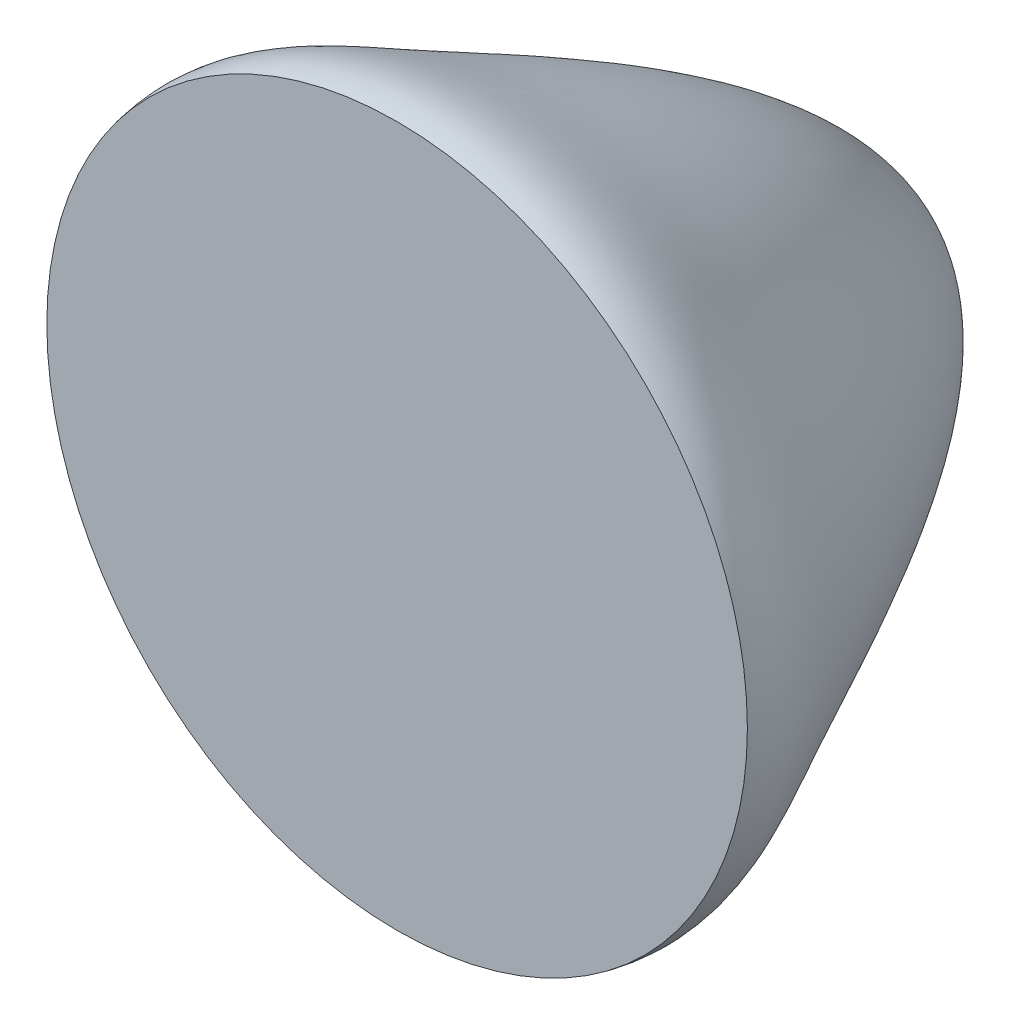
ISO-10303-21;
HEADER;
FILE_DESCRIPTION(('STEP AP214'),'2;1');
FILE_NAME('part.step','',(''),(''),'','','');
FILE_SCHEMA(('AUTOMOTIVE_DESIGN { 1 0 10303 214 1 1 1 1 }'));
ENDSEC;
DATA;
#1=APPLICATION_CONTEXT('core data for automotive mechanical design processes');
#2=APPLICATION_PROTOCOL_DEFINITION('international standard','automotive_design',2000,#1);
#3=PRODUCT_CONTEXT('',#1,'mechanical');
#4=PRODUCT('Part','Part','',(#3));
#5=PRODUCT_RELATED_PRODUCT_CATEGORY('part','',(#4));
#6=PRODUCT_DEFINITION_FORMATION('','',#4);
#7=PRODUCT_DEFINITION_CONTEXT('part definition',#1,'design');
#8=PRODUCT_DEFINITION('design','',#6,#7);
#9=PRODUCT_DEFINITION_SHAPE('','',#8);
#10=(LENGTH_UNIT() NAMED_UNIT(*) SI_UNIT(.MILLI.,.METRE.));
#11=(NAMED_UNIT(*) PLANE_ANGLE_UNIT() SI_UNIT($,.RADIAN.));
#12=(NAMED_UNIT(*) SI_UNIT($,.STERADIAN.) SOLID_ANGLE_UNIT());
#13=UNCERTAINTY_MEASURE_WITH_UNIT(LENGTH_MEASURE(1.E-05),#10,'distance_accuracy_value','');
#14=(GEOMETRIC_REPRESENTATION_CONTEXT(3) GLOBAL_UNCERTAINTY_ASSIGNED_CONTEXT((#13)) GLOBAL_UNIT_ASSIGNED_CONTEXT((#10,
#11,#12)) REPRESENTATION_CONTEXT('',''));
#15=CARTESIAN_POINT('',(0.,0.,0.));
#16=DIRECTION('',(0.,0.,1.));
#17=DIRECTION('',(1.,0.,0.));
#18=AXIS2_PLACEMENT_3D('',#15,#16,#17);
#19=CARTESIAN_POINT('',(0.,0.,-1.15));
#20=CARTESIAN_POINT('',(0.,0.319733684083505,-1.15));
#21=CARTESIAN_POINT('',(0.,0.679588811159878,-0.32165049688381));
#22=CARTESIAN_POINT('',(0.,0.821380604207943,-0.0988915868627304));
#23=CARTESIAN_POINT('',(0.,0.8,0.));
#24=B_SPLINE_CURVE_WITH_KNOTS('',3,(#19,#20,#21,#22,#23),.UNSPECIFIED.,.F.,.F.,(4,1,4),(0.,
0.634080944599834,1.),.UNSPECIFIED.);
#25=CARTESIAN_POINT('',(0.,0.,-1.15));
#26=DIRECTION('',(0.,0.,-1.));
#27=AXIS1_PLACEMENT('',#25,#26);
#28=SURFACE_OF_REVOLUTION('',#24,#27);
#29=CARTESIAN_POINT('',(0.,0.,0.));
#30=DIRECTION('',(0.,0.,-1.));
#31=DIRECTION('',(0.,1.,0.));
#32=AXIS2_PLACEMENT_3D('',#29,#30,#31);
#33=CIRCLE('',#32,0.8);
#34=CARTESIAN_POINT('',(0.,0.8,0.));
#35=VERTEX_POINT('',#34);
#36=EDGE_CURVE('E11',#35,#35,#33,.T.);
#37=ORIENTED_EDGE('',*,*,#36,.T.);
#38=EDGE_LOOP('',(#37));
#39=FACE_BOUND('',#38,.T.);
#40=CARTESIAN_POINT('',(0.,0.,-1.15));
#41=VERTEX_POINT('',#40);
#42=VERTEX_LOOP('',#41);
#43=FACE_BOUND('',#42,.T.);
#44=ADVANCED_FACE('F33',(#39,#43),#28,.F.);
#45=CARTESIAN_POINT('',(0.,0.8,0.));
#46=DIRECTION('',(0.,0.,1.));
#47=DIRECTION('',(0.,-1.,0.));
#48=AXIS2_PLACEMENT_3D('',#45,#46,#47);
#49=PLANE('',#48);
#50=ORIENTED_EDGE('',*,*,#36,.F.);
#51=EDGE_LOOP('',(#50));
#52=FACE_BOUND('',#51,.T.);
#53=ADVANCED_FACE('F42',(#52),#49,.T.);
#54=CLOSED_SHELL('',(#44,#53));
#55=MANIFOLD_SOLID_BREP('B2',#54);
#56=ADVANCED_BREP_SHAPE_REPRESENTATION('',(#18,#55),#14);
#57=SHAPE_DEFINITION_REPRESENTATION(#9,#56);
ENDSEC;
END-ISO-10303-21;
